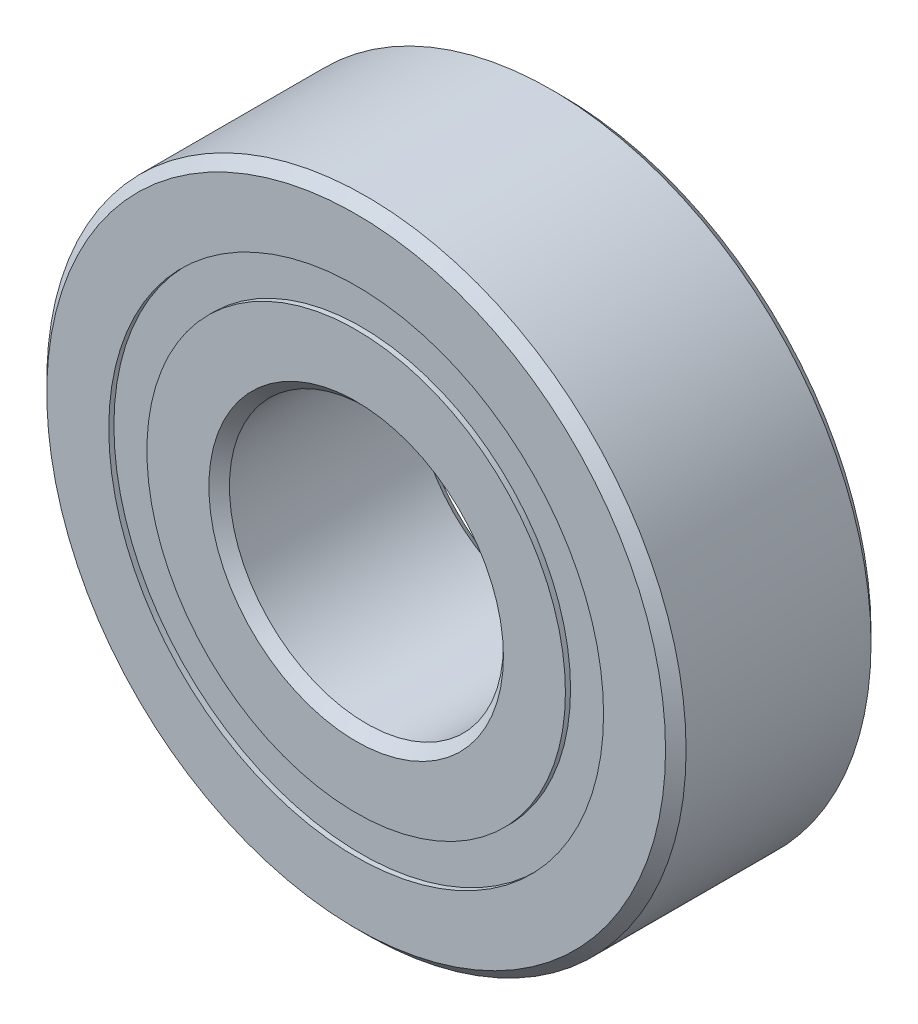
ISO-10303-21;
HEADER;
FILE_DESCRIPTION(('STEP AP214'),'2;1');
FILE_NAME('part.step','',(''),(''),'','','');
FILE_SCHEMA(('AUTOMOTIVE_DESIGN { 1 0 10303 214 1 1 1 1 }'));
ENDSEC;
DATA;
#1=APPLICATION_CONTEXT('core data for automotive mechanical design processes');
#2=APPLICATION_PROTOCOL_DEFINITION('international standard','automotive_design',2000,#1);
#3=PRODUCT_CONTEXT('',#1,'mechanical');
#4=PRODUCT('Part','Part','',(#3));
#5=PRODUCT_RELATED_PRODUCT_CATEGORY('part','',(#4));
#6=PRODUCT_DEFINITION_FORMATION('','',#4);
#7=PRODUCT_DEFINITION_CONTEXT('part definition',#1,'design');
#8=PRODUCT_DEFINITION('design','',#6,#7);
#9=PRODUCT_DEFINITION_SHAPE('','',#8);
#10=(LENGTH_UNIT() NAMED_UNIT(*) SI_UNIT(.MILLI.,.METRE.));
#11=(NAMED_UNIT(*) PLANE_ANGLE_UNIT() SI_UNIT($,.RADIAN.));
#12=(NAMED_UNIT(*) SI_UNIT($,.STERADIAN.) SOLID_ANGLE_UNIT());
#13=UNCERTAINTY_MEASURE_WITH_UNIT(LENGTH_MEASURE(1.E-05),#10,'distance_accuracy_value','');
#14=(GEOMETRIC_REPRESENTATION_CONTEXT(3) GLOBAL_UNCERTAINTY_ASSIGNED_CONTEXT((#13)) GLOBAL_UNIT_ASSIGNED_CONTEXT((#10,
#11,#12)) REPRESENTATION_CONTEXT('',''));
#15=CARTESIAN_POINT('',(0.,0.,0.));
#16=DIRECTION('',(0.,0.,1.));
#17=DIRECTION('',(1.,0.,0.));
#18=AXIS2_PLACEMENT_3D('',#15,#16,#17);
#19=CARTESIAN_POINT('',(0.,8.60041208791209,-3.39328125));
#20=DIRECTION('',(0.,0.,1.));
#21=DIRECTION('',(1.,0.,0.));
#22=AXIS2_PLACEMENT_3D('',#19,#20,#21);
#23=PLANE('',#22);
#24=CARTESIAN_POINT('',(0.,0.,-3.39328125));
#25=DIRECTION('',(0.,0.,1.));
#26=DIRECTION('',(1.,0.,0.));
#27=AXIS2_PLACEMENT_3D('',#24,#25,#26);
#28=CIRCLE('',#27,8.60041208791209);
#29=CARTESIAN_POINT('',(8.60041208791209,0.,-3.39328125));
#30=VERTEX_POINT('',#29);
#31=EDGE_CURVE('E55',#30,#30,#28,.T.);
#32=ORIENTED_EDGE('',*,*,#31,.F.);
#33=EDGE_LOOP('',(#32));
#34=FACE_BOUND('',#33,.T.);
#35=CARTESIAN_POINT('',(0.,0.,-3.39328125));
#36=DIRECTION('',(0.,0.,1.));
#37=DIRECTION('',(1.,0.,0.));
#38=AXIS2_PLACEMENT_3D('',#35,#36,#37);
#39=CIRCLE('',#38,7.27458791208791);
#40=CARTESIAN_POINT('',(7.27458791208791,0.,-3.39328125));
#41=VERTEX_POINT('',#40);
#42=EDGE_CURVE('E11',#41,#41,#39,.T.);
#43=ORIENTED_EDGE('',*,*,#42,.T.);
#44=EDGE_LOOP('',(#43));
#45=FACE_BOUND('',#44,.T.);
#46=ADVANCED_FACE('F41',(#34,#45),#23,.F.);
#47=CARTESIAN_POINT('',(0.,0.,3.571875));
#48=DIRECTION('',(0.,0.,1.));
#49=DIRECTION('',(1.,0.,0.));
#50=AXIS2_PLACEMENT_3D('',#47,#48,#49);
#51=CYLINDRICAL_SURFACE('',#50,7.27458791208791);
#52=ORIENTED_EDGE('',*,*,#42,.F.);
#53=EDGE_LOOP('',(#52));
#54=FACE_BOUND('',#53,.T.);
#55=CARTESIAN_POINT('',(0.,0.,-1.72035132641561));
#56=DIRECTION('',(0.,0.,1.));
#57=DIRECTION('',(1.,0.,0.));
#58=AXIS2_PLACEMENT_3D('',#55,#56,#57);
#59=CIRCLE('',#58,7.27458791208791);
#60=CARTESIAN_POINT('',(7.27458791208791,0.,-1.72035132641561));
#61=VERTEX_POINT('',#60);
#62=EDGE_CURVE('E47',#61,#61,#59,.T.);
#63=ORIENTED_EDGE('',*,*,#62,.T.);
#64=EDGE_LOOP('',(#63));
#65=FACE_BOUND('',#64,.T.);
#66=ADVANCED_FACE('F64',(#54,#65),#51,.F.);
#67=CARTESIAN_POINT('',(0.,8.60041208791209,-1.72035132641561));
#68=DIRECTION('',(0.,0.,-1.));
#69=DIRECTION('',(-1.,0.,0.));
#70=AXIS2_PLACEMENT_3D('',#67,#68,#69);
#71=PLANE('',#70);
#72=ORIENTED_EDGE('',*,*,#62,.F.);
#73=EDGE_LOOP('',(#72));
#74=FACE_BOUND('',#73,.T.);
#75=CARTESIAN_POINT('',(0.,0.,-1.72035132641561));
#76=DIRECTION('',(0.,0.,1.));
#77=DIRECTION('',(1.,0.,0.));
#78=AXIS2_PLACEMENT_3D('',#75,#76,#77);
#79=CIRCLE('',#78,8.60041208791209);
#80=CARTESIAN_POINT('',(8.60041208791209,0.,-1.72035132641561));
#81=VERTEX_POINT('',#80);
#82=EDGE_CURVE('E51',#81,#81,#79,.T.);
#83=ORIENTED_EDGE('',*,*,#82,.T.);
#84=EDGE_LOOP('',(#83));
#85=FACE_BOUND('',#84,.T.);
#86=ADVANCED_FACE('F68',(#74,#85),#71,.F.);
#87=CARTESIAN_POINT('',(0.,0.,3.571875));
#88=DIRECTION('',(0.,0.,1.));
#89=DIRECTION('',(1.,0.,0.));
#90=AXIS2_PLACEMENT_3D('',#87,#88,#89);
#91=CYLINDRICAL_SURFACE('',#90,8.60041208791209);
#92=ORIENTED_EDGE('',*,*,#82,.F.);
#93=EDGE_LOOP('',(#92));
#94=FACE_BOUND('',#93,.T.);
#95=ORIENTED_EDGE('',*,*,#31,.T.);
#96=EDGE_LOOP('',(#95));
#97=FACE_BOUND('',#96,.T.);
#98=ADVANCED_FACE('F61',(#94,#97),#91,.T.);
#99=CLOSED_SHELL('',(#46,#66,#86,#98));
#100=MANIFOLD_SOLID_BREP('B2',#99);
#101=CARTESIAN_POINT('',(0.,8.60041208791209,3.39328125));
#102=DIRECTION('',(0.,0.,-1.));
#103=DIRECTION('',(-1.,0.,0.));
#104=AXIS2_PLACEMENT_3D('',#101,#102,#103);
#105=PLANE('',#104);
#106=CARTESIAN_POINT('',(0.,0.,3.39328125));
#107=DIRECTION('',(0.,0.,1.));
#108=DIRECTION('',(1.,0.,0.));
#109=AXIS2_PLACEMENT_3D('',#106,#107,#108);
#110=CIRCLE('',#109,7.27458791208791);
#111=CARTESIAN_POINT('',(7.27458791208791,0.,3.39328125));
#112=VERTEX_POINT('',#111);
#113=EDGE_CURVE('E40',#112,#112,#110,.T.);
#114=ORIENTED_EDGE('',*,*,#113,.F.);
#115=EDGE_LOOP('',(#114));
#116=FACE_BOUND('',#115,.T.);
#117=CARTESIAN_POINT('',(0.,0.,3.39328125));
#118=DIRECTION('',(0.,0.,1.));
#119=DIRECTION('',(1.,0.,0.));
#120=AXIS2_PLACEMENT_3D('',#117,#118,#119);
#121=CIRCLE('',#120,8.60041208791209);
#122=CARTESIAN_POINT('',(8.60041208791209,0.,3.39328125));
#123=VERTEX_POINT('',#122);
#124=EDGE_CURVE('E122',#123,#123,#121,.T.);
#125=ORIENTED_EDGE('',*,*,#124,.T.);
#126=EDGE_LOOP('',(#125));
#127=FACE_BOUND('',#126,.T.);
#128=ADVANCED_FACE('F108',(#116,#127),#105,.F.);
#129=CARTESIAN_POINT('',(0.,0.,3.571875));
#130=DIRECTION('',(0.,0.,1.));
#131=DIRECTION('',(1.,0.,0.));
#132=AXIS2_PLACEMENT_3D('',#129,#130,#131);
#133=CYLINDRICAL_SURFACE('',#132,7.27458791208791);
#134=CARTESIAN_POINT('',(0.,0.,1.72035132641561));
#135=DIRECTION('',(0.,0.,1.));
#136=DIRECTION('',(1.,0.,0.));
#137=AXIS2_PLACEMENT_3D('',#134,#135,#136);
#138=CIRCLE('',#137,7.27458791208791);
#139=CARTESIAN_POINT('',(7.27458791208791,0.,1.72035132641561));
#140=VERTEX_POINT('',#139);
#141=EDGE_CURVE('E114',#140,#140,#138,.T.);
#142=ORIENTED_EDGE('',*,*,#141,.F.);
#143=EDGE_LOOP('',(#142));
#144=FACE_BOUND('',#143,.T.);
#145=ORIENTED_EDGE('',*,*,#113,.T.);
#146=EDGE_LOOP('',(#145));
#147=FACE_BOUND('',#146,.T.);
#148=ADVANCED_FACE('F137',(#144,#147),#133,.F.);
#149=CARTESIAN_POINT('',(0.,8.60041208791209,1.72035132641561));
#150=DIRECTION('',(0.,0.,1.));
#151=DIRECTION('',(1.,0.,0.));
#152=AXIS2_PLACEMENT_3D('',#149,#150,#151);
#153=PLANE('',#152);
#154=CARTESIAN_POINT('',(0.,0.,1.72035132641561));
#155=DIRECTION('',(0.,0.,1.));
#156=DIRECTION('',(1.,0.,0.));
#157=AXIS2_PLACEMENT_3D('',#154,#155,#156);
#158=CIRCLE('',#157,8.60041208791209);
#159=CARTESIAN_POINT('',(8.60041208791209,0.,1.72035132641561));
#160=VERTEX_POINT('',#159);
#161=EDGE_CURVE('E118',#160,#160,#158,.T.);
#162=ORIENTED_EDGE('',*,*,#161,.F.);
#163=EDGE_LOOP('',(#162));
#164=FACE_BOUND('',#163,.T.);
#165=ORIENTED_EDGE('',*,*,#141,.T.);
#166=EDGE_LOOP('',(#165));
#167=FACE_BOUND('',#166,.T.);
#168=ADVANCED_FACE('F132',(#164,#167),#153,.F.);
#169=CARTESIAN_POINT('',(0.,0.,3.571875));
#170=DIRECTION('',(0.,0.,1.));
#171=DIRECTION('',(1.,0.,0.));
#172=AXIS2_PLACEMENT_3D('',#169,#170,#171);
#173=CYLINDRICAL_SURFACE('',#172,8.60041208791209);
#174=ORIENTED_EDGE('',*,*,#124,.F.);
#175=EDGE_LOOP('',(#174));
#176=FACE_BOUND('',#175,.T.);
#177=ORIENTED_EDGE('',*,*,#161,.T.);
#178=EDGE_LOOP('',(#177));
#179=FACE_BOUND('',#178,.T.);
#180=ADVANCED_FACE('F129',(#176,#179),#173,.T.);
#181=CLOSED_SHELL('',(#128,#148,#168,#180));
#182=MANIFOLD_SOLID_BREP('B6',#181);
#183=CARTESIAN_POINT('',(-3.96874999999991,6.87407664253903,0.));
#184=DIRECTION('',(0.,0.,1.));
#185=DIRECTION('',(-0.499999999999989,0.866025403784445,0.));
#186=AXIS2_PLACEMENT_3D('',#183,#184,#185);
#187=SPHERICAL_SURFACE('',#186,1.72035132641561);
#188=CARTESIAN_POINT('',(-3.96874999999991,6.87407664253903,1.72035132641561));
#189=VERTEX_POINT('',#188);
#190=VERTEX_LOOP('',#189);
#191=FACE_BOUND('',#190,.T.);
#192=ADVANCED_FACE('F175',(#191),#187,.T.);
#193=CLOSED_SHELL('',(#192));
#194=MANIFOLD_SOLID_BREP('B35',#193);
#195=CARTESIAN_POINT('',(-6.87407664253894,3.96875000000008,0.));
#196=DIRECTION('',(0.,0.,1.));
#197=DIRECTION('',(-0.866025403784433,0.50000000000001,0.));
#198=AXIS2_PLACEMENT_3D('',#195,#196,#197);
#199=SPHERICAL_SURFACE('',#198,1.72035132641561);
#200=CARTESIAN_POINT('',(-6.87407664253894,3.96875000000008,1.72035132641561));
#201=VERTEX_POINT('',#200);
#202=VERTEX_LOOP('',#201);
#203=FACE_BOUND('',#202,.T.);
#204=ADVANCED_FACE('F195',(#203),#199,.T.);
#205=CLOSED_SHELL('',(#204));
#206=MANIFOLD_SOLID_BREP('B104',#205);
#207=CARTESIAN_POINT('',(-7.9375,0.,0.));
#208=DIRECTION('',(0.,0.,1.));
#209=DIRECTION('',(-1.,0.,0.));
#210=AXIS2_PLACEMENT_3D('',#207,#208,#209);
#211=SPHERICAL_SURFACE('',#210,1.72035132641561);
#212=CARTESIAN_POINT('',(-7.9375,0.,1.72035132641561));
#213=VERTEX_POINT('',#212);
#214=VERTEX_LOOP('',#213);
#215=FACE_BOUND('',#214,.T.);
#216=ADVANCED_FACE('F215',(#215),#211,.T.);
#217=CLOSED_SHELL('',(#216));
#218=MANIFOLD_SOLID_BREP('B171',#217);
#219=CARTESIAN_POINT('',(-6.87407664253902,-3.96874999999994,0.));
#220=DIRECTION('',(0.,0.,1.));
#221=DIRECTION('',(-0.866025403784443,-0.499999999999992,0.));
#222=AXIS2_PLACEMENT_3D('',#219,#220,#221);
#223=SPHERICAL_SURFACE('',#222,1.72035132641561);
#224=CARTESIAN_POINT('',(-6.87407664253902,-3.96874999999994,1.72035132641561));
#225=VERTEX_POINT('',#224);
#226=VERTEX_LOOP('',#225);
#227=FACE_BOUND('',#226,.T.);
#228=ADVANCED_FACE('F235',(#227),#223,.T.);
#229=CLOSED_SHELL('',(#228));
#230=MANIFOLD_SOLID_BREP('B191',#229);
#231=CARTESIAN_POINT('',(-3.96875000000006,-6.87407664253895,0.));
#232=DIRECTION('',(0.,0.,1.));
#233=DIRECTION('',(-0.500000000000007,-0.866025403784435,0.));
#234=AXIS2_PLACEMENT_3D('',#231,#232,#233);
#235=SPHERICAL_SURFACE('',#234,1.72035132641561);
#236=CARTESIAN_POINT('',(-3.96875000000006,-6.87407664253895,1.72035132641561));
#237=VERTEX_POINT('',#236);
#238=VERTEX_LOOP('',#237);
#239=FACE_BOUND('',#238,.T.);
#240=ADVANCED_FACE('F255',(#239),#235,.T.);
#241=CLOSED_SHELL('',(#240));
#242=MANIFOLD_SOLID_BREP('B211',#241);
#243=CARTESIAN_POINT('',(0.,-7.9375,0.));
#244=DIRECTION('',(0.,0.,1.));
#245=DIRECTION('',(0.,-1.,0.));
#246=AXIS2_PLACEMENT_3D('',#243,#244,#245);
#247=SPHERICAL_SURFACE('',#246,1.72035132641561);
#248=CARTESIAN_POINT('',(0.,-7.9375,1.72035132641561));
#249=VERTEX_POINT('',#248);
#250=VERTEX_LOOP('',#249);
#251=FACE_BOUND('',#250,.T.);
#252=ADVANCED_FACE('F275',(#251),#247,.T.);
#253=CLOSED_SHELL('',(#252));
#254=MANIFOLD_SOLID_BREP('B231',#253);
#255=CARTESIAN_POINT('',(3.96874999999996,-6.87407664253901,0.));
#256=DIRECTION('',(0.,0.,1.));
#257=DIRECTION('',(0.499999999999995,-0.866025403784442,0.));
#258=AXIS2_PLACEMENT_3D('',#255,#256,#257);
#259=SPHERICAL_SURFACE('',#258,1.72035132641561);
#260=CARTESIAN_POINT('',(3.96874999999996,-6.87407664253901,1.72035132641561));
#261=VERTEX_POINT('',#260);
#262=VERTEX_LOOP('',#261);
#263=FACE_BOUND('',#262,.T.);
#264=ADVANCED_FACE('F295',(#263),#259,.T.);
#265=CLOSED_SHELL('',(#264));
#266=MANIFOLD_SOLID_BREP('B251',#265);
#267=CARTESIAN_POINT('',(6.87407664253896,-3.96875000000003,0.));
#268=DIRECTION('',(0.,0.,1.));
#269=DIRECTION('',(0.866025403784436,-0.500000000000004,0.));
#270=AXIS2_PLACEMENT_3D('',#267,#268,#269);
#271=SPHERICAL_SURFACE('',#270,1.72035132641561);
#272=CARTESIAN_POINT('',(6.87407664253896,-3.96875000000003,1.72035132641561));
#273=VERTEX_POINT('',#272);
#274=VERTEX_LOOP('',#273);
#275=FACE_BOUND('',#274,.T.);
#276=ADVANCED_FACE('F315',(#275),#271,.T.);
#277=CLOSED_SHELL('',(#276));
#278=MANIFOLD_SOLID_BREP('B271',#277);
#279=CARTESIAN_POINT('',(7.9375,0.,0.));
#280=DIRECTION('',(0.,0.,1.));
#281=DIRECTION('',(1.,0.,0.));
#282=AXIS2_PLACEMENT_3D('',#279,#280,#281);
#283=SPHERICAL_SURFACE('',#282,1.72035132641561);
#284=CARTESIAN_POINT('',(7.9375,0.,1.72035132641561));
#285=VERTEX_POINT('',#284);
#286=VERTEX_LOOP('',#285);
#287=FACE_BOUND('',#286,.T.);
#288=ADVANCED_FACE('F335',(#287),#283,.T.);
#289=CLOSED_SHELL('',(#288));
#290=MANIFOLD_SOLID_BREP('B291',#289);
#291=CARTESIAN_POINT('',(6.87407664253899,3.96874999999998,0.));
#292=DIRECTION('',(0.,0.,1.));
#293=DIRECTION('',(0.86602540378444,0.499999999999998,0.));
#294=AXIS2_PLACEMENT_3D('',#291,#292,#293);
#295=SPHERICAL_SURFACE('',#294,1.72035132641561);
#296=CARTESIAN_POINT('',(6.87407664253899,3.96874999999998,1.72035132641561));
#297=VERTEX_POINT('',#296);
#298=VERTEX_LOOP('',#297);
#299=FACE_BOUND('',#298,.T.);
#300=ADVANCED_FACE('F355',(#299),#295,.T.);
#301=CLOSED_SHELL('',(#300));
#302=MANIFOLD_SOLID_BREP('B311',#301);
#303=CARTESIAN_POINT('',(3.96875000000001,6.87407664253898,0.));
#304=DIRECTION('',(0.,0.,1.));
#305=DIRECTION('',(0.500000000000001,0.866025403784438,0.));
#306=AXIS2_PLACEMENT_3D('',#303,#304,#305);
#307=SPHERICAL_SURFACE('',#306,1.72035132641561);
#308=CARTESIAN_POINT('',(3.96875000000001,6.87407664253898,1.72035132641561));
#309=VERTEX_POINT('',#308);
#310=VERTEX_LOOP('',#309);
#311=FACE_BOUND('',#310,.T.);
#312=ADVANCED_FACE('F375',(#311),#307,.T.);
#313=CLOSED_SHELL('',(#312));
#314=MANIFOLD_SOLID_BREP('B331',#313);
#315=CARTESIAN_POINT('',(0.,7.9375,0.));
#316=DIRECTION('',(0.,0.,1.));
#317=DIRECTION('',(0.,1.,0.));
#318=AXIS2_PLACEMENT_3D('',#315,#316,#317);
#319=SPHERICAL_SURFACE('',#318,1.72035132641561);
#320=CARTESIAN_POINT('',(0.,7.9375,1.72035132641561));
#321=VERTEX_POINT('',#320);
#322=VERTEX_LOOP('',#321);
#323=FACE_BOUND('',#322,.T.);
#324=ADVANCED_FACE('F397',(#323),#319,.T.);
#325=CLOSED_SHELL('',(#324));
#326=MANIFOLD_SOLID_BREP('B351',#325);
#327=CARTESIAN_POINT('',(0.,7.27458791208791,3.571875));
#328=DIRECTION('',(0.,0.,-1.));
#329=DIRECTION('',(-1.,0.,0.));
#330=AXIS2_PLACEMENT_3D('',#327,#328,#329);
#331=PLANE('',#330);
#332=CARTESIAN_POINT('',(0.,0.,3.571875));
#333=DIRECTION('',(0.,0.,1.));
#334=DIRECTION('',(1.,0.,0.));
#335=AXIS2_PLACEMENT_3D('',#332,#333,#334);
#336=CIRCLE('',#335,5.1196875);
#337=CARTESIAN_POINT('',(5.1196875,0.,3.571875));
#338=VERTEX_POINT('',#337);
#339=EDGE_CURVE('E444',#338,#338,#336,.T.);
#340=ORIENTED_EDGE('',*,*,#339,.F.);
#341=EDGE_LOOP('',(#340));
#342=FACE_BOUND('',#341,.T.);
#343=CARTESIAN_POINT('',(0.,0.,3.571875));
#344=DIRECTION('',(0.,0.,1.));
#345=DIRECTION('',(1.,0.,0.));
#346=AXIS2_PLACEMENT_3D('',#343,#344,#345);
#347=CIRCLE('',#346,7.27458791208791);
#348=CARTESIAN_POINT('',(7.27458791208791,0.,3.571875));
#349=VERTEX_POINT('',#348);
#350=EDGE_CURVE('E396',#349,#349,#347,.T.);
#351=ORIENTED_EDGE('',*,*,#350,.T.);
#352=EDGE_LOOP('',(#351));
#353=FACE_BOUND('',#352,.T.);
#354=ADVANCED_FACE('F416',(#342,#353),#331,.F.);
#355=CARTESIAN_POINT('',(0.,0.,3.571875));
#356=DIRECTION('',(0.,0.,1.));
#357=DIRECTION('',(1.,0.,0.));
#358=AXIS2_PLACEMENT_3D('',#355,#356,#357);
#359=CYLINDRICAL_SURFACE('',#358,7.27458791208791);
#360=ORIENTED_EDGE('',*,*,#350,.F.);
#361=EDGE_LOOP('',(#360));
#362=FACE_BOUND('',#361,.T.);
#363=CARTESIAN_POINT('',(0.,0.,1.5875));
#364=DIRECTION('',(0.,0.,1.));
#365=DIRECTION('',(1.,0.,0.));
#366=AXIS2_PLACEMENT_3D('',#363,#364,#365);
#367=CIRCLE('',#366,7.27458791208791);
#368=CARTESIAN_POINT('',(7.27458791208791,0.,1.5875));
#369=VERTEX_POINT('',#368);
#370=EDGE_CURVE('E422',#369,#369,#367,.T.);
#371=ORIENTED_EDGE('',*,*,#370,.T.);
#372=EDGE_LOOP('',(#371));
#373=FACE_BOUND('',#372,.T.);
#374=ADVANCED_FACE('F451',(#362,#373),#359,.T.);
#375=CARTESIAN_POINT('',(0.,0.,0.));
#376=DIRECTION('',(0.,0.,1.));
#377=DIRECTION('',(1.,0.,0.));
#378=AXIS2_PLACEMENT_3D('',#375,#376,#377);
#379=TOROIDAL_SURFACE('',#378,7.93749999999999,1.72035132641561);
#380=ORIENTED_EDGE('',*,*,#370,.F.);
#381=EDGE_LOOP('',(#380));
#382=FACE_BOUND('',#381,.T.);
#383=CARTESIAN_POINT('',(0.,0.,-1.5875));
#384=DIRECTION('',(0.,0.,1.));
#385=DIRECTION('',(1.,0.,0.));
#386=AXIS2_PLACEMENT_3D('',#383,#384,#385);
#387=CIRCLE('',#386,7.27458791208791);
#388=CARTESIAN_POINT('',(7.27458791208791,0.,-1.5875));
#389=VERTEX_POINT('',#388);
#390=EDGE_CURVE('E426',#389,#389,#387,.T.);
#391=ORIENTED_EDGE('',*,*,#390,.T.);
#392=EDGE_LOOP('',(#391));
#393=FACE_BOUND('',#392,.T.);
#394=ADVANCED_FACE('F455',(#382,#393),#379,.F.);
#395=CARTESIAN_POINT('',(0.,0.,3.571875));
#396=DIRECTION('',(0.,0.,1.));
#397=DIRECTION('',(1.,0.,0.));
#398=AXIS2_PLACEMENT_3D('',#395,#396,#397);
#399=CYLINDRICAL_SURFACE('',#398,7.27458791208791);
#400=ORIENTED_EDGE('',*,*,#390,.F.);
#401=EDGE_LOOP('',(#400));
#402=FACE_BOUND('',#401,.T.);
#403=CARTESIAN_POINT('',(0.,0.,-3.571875));
#404=DIRECTION('',(0.,0.,1.));
#405=DIRECTION('',(1.,0.,0.));
#406=AXIS2_PLACEMENT_3D('',#403,#404,#405);
#407=CIRCLE('',#406,7.27458791208791);
#408=CARTESIAN_POINT('',(7.27458791208791,0.,-3.571875));
#409=VERTEX_POINT('',#408);
#410=EDGE_CURVE('E430',#409,#409,#407,.T.);
#411=ORIENTED_EDGE('',*,*,#410,.T.);
#412=EDGE_LOOP('',(#411));
#413=FACE_BOUND('',#412,.T.);
#414=ADVANCED_FACE('F460',(#402,#413),#399,.T.);
#415=CARTESIAN_POINT('',(0.,5.1196875,-3.571875));
#416=DIRECTION('',(0.,0.,1.));
#417=DIRECTION('',(1.,0.,0.));
#418=AXIS2_PLACEMENT_3D('',#415,#416,#417);
#419=PLANE('',#418);
#420=ORIENTED_EDGE('',*,*,#410,.F.);
#421=EDGE_LOOP('',(#420));
#422=FACE_BOUND('',#421,.T.);
#423=CARTESIAN_POINT('',(0.,0.,-3.571875));
#424=DIRECTION('',(0.,0.,1.));
#425=DIRECTION('',(1.,0.,0.));
#426=AXIS2_PLACEMENT_3D('',#423,#424,#425);
#427=CIRCLE('',#426,5.1196875);
#428=CARTESIAN_POINT('',(5.1196875,0.,-3.571875));
#429=VERTEX_POINT('',#428);
#430=EDGE_CURVE('E435',#429,#429,#427,.T.);
#431=ORIENTED_EDGE('',*,*,#430,.T.);
#432=EDGE_LOOP('',(#431));
#433=FACE_BOUND('',#432,.T.);
#434=ADVANCED_FACE('F466',(#422,#433),#419,.F.);
#435=CARTESIAN_POINT('',(0.,0.,-3.2146875));
#436=DIRECTION('',(0.,0.,-1.));
#437=DIRECTION('',(-1.,0.,0.));
#438=AXIS2_PLACEMENT_3D('',#435,#436,#437);
#439=CONICAL_SURFACE('',#438,4.7625,0.785398163397447);
#440=ORIENTED_EDGE('',*,*,#430,.F.);
#441=EDGE_LOOP('',(#440));
#442=FACE_BOUND('',#441,.T.);
#443=CARTESIAN_POINT('',(0.,0.,-3.2146875));
#444=DIRECTION('',(0.,0.,1.));
#445=DIRECTION('',(1.,0.,0.));
#446=AXIS2_PLACEMENT_3D('',#443,#444,#445);
#447=CIRCLE('',#446,4.7625);
#448=CARTESIAN_POINT('',(4.7625,0.,-3.2146875));
#449=VERTEX_POINT('',#448);
#450=EDGE_CURVE('E438',#449,#449,#447,.T.);
#451=ORIENTED_EDGE('',*,*,#450,.T.);
#452=EDGE_LOOP('',(#451));
#453=FACE_BOUND('',#452,.T.);
#454=ADVANCED_FACE('F470',(#442,#453),#439,.F.);
#455=CARTESIAN_POINT('',(0.,0.,3.571875));
#456=DIRECTION('',(0.,0.,1.));
#457=DIRECTION('',(1.,0.,0.));
#458=AXIS2_PLACEMENT_3D('',#455,#456,#457);
#459=CYLINDRICAL_SURFACE('',#458,4.7625);
#460=ORIENTED_EDGE('',*,*,#450,.F.);
#461=EDGE_LOOP('',(#460));
#462=FACE_BOUND('',#461,.T.);
#463=CARTESIAN_POINT('',(0.,0.,3.2146875));
#464=DIRECTION('',(0.,0.,1.));
#465=DIRECTION('',(1.,0.,0.));
#466=AXIS2_PLACEMENT_3D('',#463,#464,#465);
#467=CIRCLE('',#466,4.7625);
#468=CARTESIAN_POINT('',(4.7625,0.,3.2146875));
#469=VERTEX_POINT('',#468);
#470=EDGE_CURVE('E441',#469,#469,#467,.T.);
#471=ORIENTED_EDGE('',*,*,#470,.T.);
#472=EDGE_LOOP('',(#471));
#473=FACE_BOUND('',#472,.T.);
#474=ADVANCED_FACE('F474',(#462,#473),#459,.F.);
#475=CARTESIAN_POINT('',(0.,0.,3.571875));
#476=DIRECTION('',(0.,0.,1.));
#477=DIRECTION('',(1.,0.,0.));
#478=AXIS2_PLACEMENT_3D('',#475,#476,#477);
#479=CONICAL_SURFACE('',#478,5.1196875,0.785398163397451);
#480=ORIENTED_EDGE('',*,*,#470,.F.);
#481=EDGE_LOOP('',(#480));
#482=FACE_BOUND('',#481,.T.);
#483=ORIENTED_EDGE('',*,*,#339,.T.);
#484=EDGE_LOOP('',(#483));
#485=FACE_BOUND('',#484,.T.);
#486=ADVANCED_FACE('F448',(#482,#485),#479,.F.);
#487=CLOSED_SHELL('',(#354,#374,#394,#414,#434,#454,#474,#486));
#488=MANIFOLD_SOLID_BREP('B371',#487);
#489=CARTESIAN_POINT('',(0.,0.,3.2146875));
#490=DIRECTION('',(0.,0.,-1.));
#491=DIRECTION('',(-1.,0.,0.));
#492=AXIS2_PLACEMENT_3D('',#489,#490,#491);
#493=CONICAL_SURFACE('',#492,11.1125,0.785398163397446);
#494=CARTESIAN_POINT('',(0.,0.,3.571875));
#495=DIRECTION('',(0.,0.,1.));
#496=DIRECTION('',(1.,0.,0.));
#497=AXIS2_PLACEMENT_3D('',#494,#495,#496);
#498=CIRCLE('',#497,10.7553125);
#499=CARTESIAN_POINT('',(10.7553125,0.,3.571875));
#500=VERTEX_POINT('',#499);
#501=EDGE_CURVE('E565',#500,#500,#498,.T.);
#502=ORIENTED_EDGE('',*,*,#501,.F.);
#503=EDGE_LOOP('',(#502));
#504=FACE_BOUND('',#503,.T.);
#505=CARTESIAN_POINT('',(0.,0.,3.2146875));
#506=DIRECTION('',(0.,0.,1.));
#507=DIRECTION('',(1.,0.,0.));
#508=AXIS2_PLACEMENT_3D('',#505,#506,#507);
#509=CIRCLE('',#508,11.1125);
#510=CARTESIAN_POINT('',(11.1125,0.,3.2146875));
#511=VERTEX_POINT('',#510);
#512=EDGE_CURVE('E415',#511,#511,#509,.T.);
#513=ORIENTED_EDGE('',*,*,#512,.T.);
#514=EDGE_LOOP('',(#513));
#515=FACE_BOUND('',#514,.T.);
#516=ADVANCED_FACE('F537',(#504,#515),#493,.T.);
#517=CARTESIAN_POINT('',(0.,0.,3.571875));
#518=DIRECTION('',(0.,0.,1.));
#519=DIRECTION('',(1.,0.,0.));
#520=AXIS2_PLACEMENT_3D('',#517,#518,#519);
#521=CYLINDRICAL_SURFACE('',#520,11.1125);
#522=ORIENTED_EDGE('',*,*,#512,.F.);
#523=EDGE_LOOP('',(#522));
#524=FACE_BOUND('',#523,.T.);
#525=CARTESIAN_POINT('',(0.,0.,-3.2146875));
#526=DIRECTION('',(0.,0.,1.));
#527=DIRECTION('',(1.,0.,0.));
#528=AXIS2_PLACEMENT_3D('',#525,#526,#527);
#529=CIRCLE('',#528,11.1125);
#530=CARTESIAN_POINT('',(11.1125,0.,-3.2146875));
#531=VERTEX_POINT('',#530);
#532=EDGE_CURVE('E543',#531,#531,#529,.T.);
#533=ORIENTED_EDGE('',*,*,#532,.T.);
#534=EDGE_LOOP('',(#533));
#535=FACE_BOUND('',#534,.T.);
#536=ADVANCED_FACE('F572',(#524,#535),#521,.T.);
#537=CARTESIAN_POINT('',(0.,0.,-3.571875));
#538=DIRECTION('',(0.,0.,1.));
#539=DIRECTION('',(1.,0.,0.));
#540=AXIS2_PLACEMENT_3D('',#537,#538,#539);
#541=CONICAL_SURFACE('',#540,10.7553125,0.785398163397444);
#542=ORIENTED_EDGE('',*,*,#532,.F.);
#543=EDGE_LOOP('',(#542));
#544=FACE_BOUND('',#543,.T.);
#545=CARTESIAN_POINT('',(0.,0.,-3.571875));
#546=DIRECTION('',(0.,0.,1.));
#547=DIRECTION('',(1.,0.,0.));
#548=AXIS2_PLACEMENT_3D('',#545,#546,#547);
#549=CIRCLE('',#548,10.7553125);
#550=CARTESIAN_POINT('',(10.7553125,0.,-3.571875));
#551=VERTEX_POINT('',#550);
#552=EDGE_CURVE('E547',#551,#551,#549,.T.);
#553=ORIENTED_EDGE('',*,*,#552,.T.);
#554=EDGE_LOOP('',(#553));
#555=FACE_BOUND('',#554,.T.);
#556=ADVANCED_FACE('F576',(#544,#555),#541,.T.);
#557=CARTESIAN_POINT('',(0.,10.7553125,-3.571875));
#558=DIRECTION('',(0.,0.,1.));
#559=DIRECTION('',(1.,0.,0.));
#560=AXIS2_PLACEMENT_3D('',#557,#558,#559);
#561=PLANE('',#560);
#562=ORIENTED_EDGE('',*,*,#552,.F.);
#563=EDGE_LOOP('',(#562));
#564=FACE_BOUND('',#563,.T.);
#565=CARTESIAN_POINT('',(0.,0.,-3.571875));
#566=DIRECTION('',(0.,0.,1.));
#567=DIRECTION('',(1.,0.,0.));
#568=AXIS2_PLACEMENT_3D('',#565,#566,#567);
#569=CIRCLE('',#568,8.60041208791209);
#570=CARTESIAN_POINT('',(8.60041208791209,0.,-3.571875));
#571=VERTEX_POINT('',#570);
#572=EDGE_CURVE('E551',#571,#571,#569,.T.);
#573=ORIENTED_EDGE('',*,*,#572,.T.);
#574=EDGE_LOOP('',(#573));
#575=FACE_BOUND('',#574,.T.);
#576=ADVANCED_FACE('F581',(#564,#575),#561,.F.);
#577=CARTESIAN_POINT('',(0.,0.,3.571875));
#578=DIRECTION('',(0.,0.,1.));
#579=DIRECTION('',(1.,0.,0.));
#580=AXIS2_PLACEMENT_3D('',#577,#578,#579);
#581=CYLINDRICAL_SURFACE('',#580,8.60041208791209);
#582=ORIENTED_EDGE('',*,*,#572,.F.);
#583=EDGE_LOOP('',(#582));
#584=FACE_BOUND('',#583,.T.);
#585=CARTESIAN_POINT('',(0.,0.,-1.5875));
#586=DIRECTION('',(0.,0.,1.));
#587=DIRECTION('',(1.,0.,0.));
#588=AXIS2_PLACEMENT_3D('',#585,#586,#587);
#589=CIRCLE('',#588,8.60041208791209);
#590=CARTESIAN_POINT('',(8.60041208791209,0.,-1.5875));
#591=VERTEX_POINT('',#590);
#592=EDGE_CURVE('E556',#591,#591,#589,.T.);
#593=ORIENTED_EDGE('',*,*,#592,.T.);
#594=EDGE_LOOP('',(#593));
#595=FACE_BOUND('',#594,.T.);
#596=ADVANCED_FACE('F587',(#584,#595),#581,.F.);
#597=CARTESIAN_POINT('',(0.,0.,0.));
#598=DIRECTION('',(0.,0.,1.));
#599=DIRECTION('',(1.,0.,0.));
#600=AXIS2_PLACEMENT_3D('',#597,#598,#599);
#601=TOROIDAL_SURFACE('',#600,7.9375,1.72035132641561);
#602=ORIENTED_EDGE('',*,*,#592,.F.);
#603=EDGE_LOOP('',(#602));
#604=FACE_BOUND('',#603,.T.);
#605=CARTESIAN_POINT('',(0.,0.,1.5875));
#606=DIRECTION('',(0.,0.,1.));
#607=DIRECTION('',(1.,0.,0.));
#608=AXIS2_PLACEMENT_3D('',#605,#606,#607);
#609=CIRCLE('',#608,8.60041208791209);
#610=CARTESIAN_POINT('',(8.60041208791209,0.,1.5875));
#611=VERTEX_POINT('',#610);
#612=EDGE_CURVE('E559',#611,#611,#609,.T.);
#613=ORIENTED_EDGE('',*,*,#612,.T.);
#614=EDGE_LOOP('',(#613));
#615=FACE_BOUND('',#614,.T.);
#616=ADVANCED_FACE('F591',(#604,#615),#601,.F.);
#617=CARTESIAN_POINT('',(0.,0.,3.571875));
#618=DIRECTION('',(0.,0.,1.));
#619=DIRECTION('',(1.,0.,0.));
#620=AXIS2_PLACEMENT_3D('',#617,#618,#619);
#621=CYLINDRICAL_SURFACE('',#620,8.60041208791209);
#622=ORIENTED_EDGE('',*,*,#612,.F.);
#623=EDGE_LOOP('',(#622));
#624=FACE_BOUND('',#623,.T.);
#625=CARTESIAN_POINT('',(0.,0.,3.571875));
#626=DIRECTION('',(0.,0.,1.));
#627=DIRECTION('',(1.,0.,0.));
#628=AXIS2_PLACEMENT_3D('',#625,#626,#627);
#629=CIRCLE('',#628,8.60041208791209);
#630=CARTESIAN_POINT('',(8.60041208791209,0.,3.571875));
#631=VERTEX_POINT('',#630);
#632=EDGE_CURVE('E562',#631,#631,#629,.T.);
#633=ORIENTED_EDGE('',*,*,#632,.T.);
#634=EDGE_LOOP('',(#633));
#635=FACE_BOUND('',#634,.T.);
#636=ADVANCED_FACE('F595',(#624,#635),#621,.F.);
#637=CARTESIAN_POINT('',(0.,10.7553125,3.571875));
#638=DIRECTION('',(0.,0.,-1.));
#639=DIRECTION('',(-1.,0.,0.));
#640=AXIS2_PLACEMENT_3D('',#637,#638,#639);
#641=PLANE('',#640);
#642=ORIENTED_EDGE('',*,*,#632,.F.);
#643=EDGE_LOOP('',(#642));
#644=FACE_BOUND('',#643,.T.);
#645=ORIENTED_EDGE('',*,*,#501,.T.);
#646=EDGE_LOOP('',(#645));
#647=FACE_BOUND('',#646,.T.);
#648=ADVANCED_FACE('F569',(#644,#647),#641,.F.);
#649=CLOSED_SHELL('',(#516,#536,#556,#576,#596,#616,#636,#648));
#650=MANIFOLD_SOLID_BREP('B391',#649);
#651=ADVANCED_BREP_SHAPE_REPRESENTATION('',(#18,#100,#182,#194,#206,#218,#230,#242,#254,#266,
#278,#290,#302,#314,#326,#488,#650),#14);
#652=SHAPE_DEFINITION_REPRESENTATION(#9,#651);
ENDSEC;
END-ISO-10303-21;
